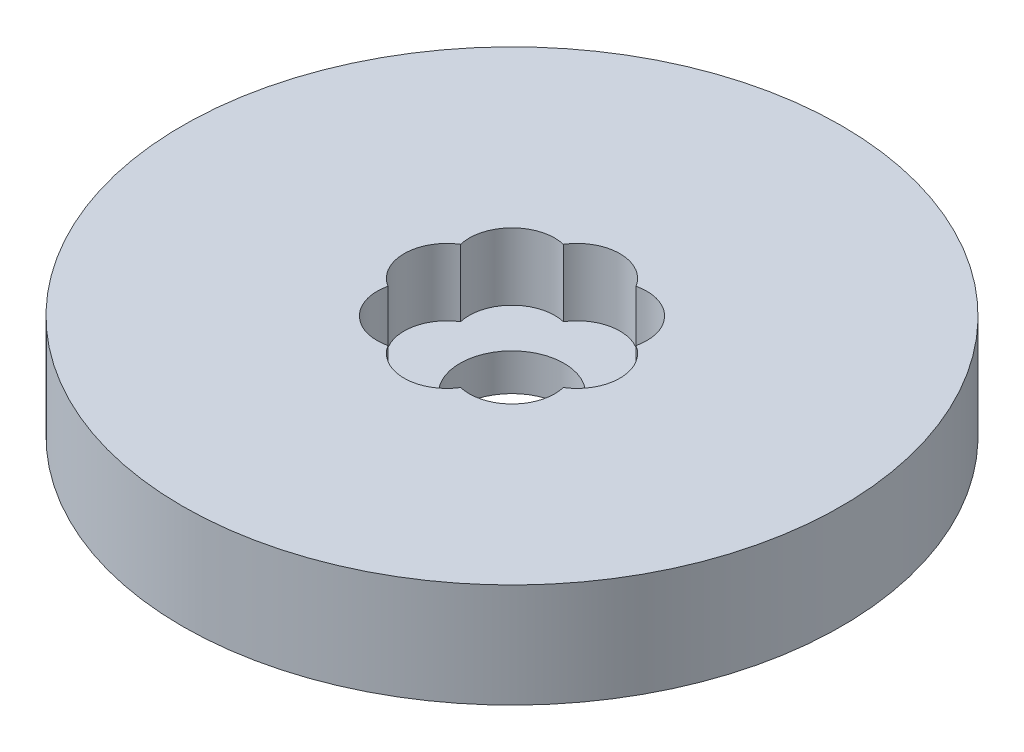
ISO-10303-21;
HEADER;
FILE_DESCRIPTION(('STEP AP214'),'2;1');
FILE_NAME('part.step','',(''),(''),'','','');
FILE_SCHEMA(('AUTOMOTIVE_DESIGN { 1 0 10303 214 1 1 1 1 }'));
ENDSEC;
DATA;
#1=APPLICATION_CONTEXT('core data for automotive mechanical design processes');
#2=APPLICATION_PROTOCOL_DEFINITION('international standard','automotive_design',2000,#1);
#3=PRODUCT_CONTEXT('',#1,'mechanical');
#4=PRODUCT('Part','Part','',(#3));
#5=PRODUCT_RELATED_PRODUCT_CATEGORY('part','',(#4));
#6=PRODUCT_DEFINITION_FORMATION('','',#4);
#7=PRODUCT_DEFINITION_CONTEXT('part definition',#1,'design');
#8=PRODUCT_DEFINITION('design','',#6,#7);
#9=PRODUCT_DEFINITION_SHAPE('','',#8);
#10=(LENGTH_UNIT() NAMED_UNIT(*) SI_UNIT(.MILLI.,.METRE.));
#11=(NAMED_UNIT(*) PLANE_ANGLE_UNIT() SI_UNIT($,.RADIAN.));
#12=(NAMED_UNIT(*) SI_UNIT($,.STERADIAN.) SOLID_ANGLE_UNIT());
#13=UNCERTAINTY_MEASURE_WITH_UNIT(LENGTH_MEASURE(1.E-05),#10,'distance_accuracy_value','');
#14=(GEOMETRIC_REPRESENTATION_CONTEXT(3) GLOBAL_UNCERTAINTY_ASSIGNED_CONTEXT((#13)) GLOBAL_UNIT_ASSIGNED_CONTEXT((#10,
#11,#12)) REPRESENTATION_CONTEXT('',''));
#15=CARTESIAN_POINT('',(0.,0.,0.));
#16=DIRECTION('',(0.,0.,1.));
#17=DIRECTION('',(1.,0.,0.));
#18=AXIS2_PLACEMENT_3D('',#15,#16,#17);
#19=CARTESIAN_POINT('',(0.,15.,0.));
#20=DIRECTION('',(0.,-1.,0.));
#21=DIRECTION('',(0.,0.,-1.));
#22=AXIS2_PLACEMENT_3D('',#19,#20,#21);
#23=CYLINDRICAL_SURFACE('',#22,7.5);
#24=CARTESIAN_POINT('',(0.,0.,0.));
#25=DIRECTION('',(0.,1.,0.));
#26=DIRECTION('',(0.,0.,1.));
#27=AXIS2_PLACEMENT_3D('',#24,#25,#26);
#28=CIRCLE('',#27,7.5);
#29=CARTESIAN_POINT('',(0.,0.,7.5));
#30=VERTEX_POINT('',#29);
#31=EDGE_CURVE('E166',#30,#30,#28,.T.);
#32=ORIENTED_EDGE('',*,*,#31,.F.);
#33=EDGE_LOOP('',(#32));
#34=FACE_BOUND('',#33,.T.);
#35=CARTESIAN_POINT('',(0.,5.33845632988203,0.));
#36=DIRECTION('',(0.,1.,0.));
#37=DIRECTION('',(0.,0.,1.));
#38=AXIS2_PLACEMENT_3D('',#35,#36,#37);
#39=CIRCLE('',#38,7.5);
#40=CARTESIAN_POINT('',(0.,5.33845632988203,7.5));
#41=VERTEX_POINT('',#40);
#42=EDGE_CURVE('E11',#41,#41,#39,.T.);
#43=ORIENTED_EDGE('',*,*,#42,.T.);
#44=EDGE_LOOP('',(#43));
#45=FACE_BOUND('',#44,.T.);
#46=ADVANCED_FACE('F39',(#34,#45),#23,.F.);
#47=CARTESIAN_POINT('',(0.,15.,0.));
#48=DIRECTION('',(0.,-1.,0.));
#49=DIRECTION('',(0.,0.,-1.));
#50=AXIS2_PLACEMENT_3D('',#47,#48,#49);
#51=CYLINDRICAL_SURFACE('',#50,47.5);
#52=CARTESIAN_POINT('',(0.,15.,0.));
#53=DIRECTION('',(0.,1.,0.));
#54=DIRECTION('',(0.,0.,1.));
#55=AXIS2_PLACEMENT_3D('',#52,#53,#54);
#56=CIRCLE('',#55,47.5);
#57=CARTESIAN_POINT('',(0.,15.,47.5));
#58=VERTEX_POINT('',#57);
#59=EDGE_CURVE('E50',#58,#58,#56,.T.);
#60=ORIENTED_EDGE('',*,*,#59,.F.);
#61=EDGE_LOOP('',(#60));
#62=FACE_BOUND('',#61,.T.);
#63=CARTESIAN_POINT('',(0.,0.,0.));
#64=DIRECTION('',(0.,1.,0.));
#65=DIRECTION('',(0.,0.,1.));
#66=AXIS2_PLACEMENT_3D('',#63,#64,#65);
#67=CIRCLE('',#66,47.5);
#68=CARTESIAN_POINT('',(0.,0.,47.5));
#69=VERTEX_POINT('',#68);
#70=EDGE_CURVE('E173',#69,#69,#67,.T.);
#71=ORIENTED_EDGE('',*,*,#70,.T.);
#72=EDGE_LOOP('',(#71));
#73=FACE_BOUND('',#72,.T.);
#74=ADVANCED_FACE('F41',(#62,#73),#51,.T.);
#75=CARTESIAN_POINT('',(0.,15.,0.));
#76=DIRECTION('',(0.,1.,0.));
#77=DIRECTION('',(0.,0.,1.));
#78=AXIS2_PLACEMENT_3D('',#75,#76,#77);
#79=PLANE('',#78);
#80=CARTESIAN_POINT('',(-6.6401751399575,15.,6.64017513995752));
#81=DIRECTION('',(0.,1.,0.));
#82=DIRECTION('',(0.707106781186549,0.,0.707106781186546));
#83=AXIS2_PLACEMENT_3D('',#80,#81,#82);
#84=CIRCLE('',#83,6.16360601817822);
#85=CARTESIAN_POINT('',(-12.6417970127063,15.,5.23640377543065));
#86=VERTEX_POINT('',#85);
#87=CARTESIAN_POINT('',(-5.23640377543061,15.,12.6417970127063));
#88=VERTEX_POINT('',#87);
#89=EDGE_CURVE('E159',#86,#88,#84,.T.);
#90=ORIENTED_EDGE('',*,*,#89,.F.);
#91=CARTESIAN_POINT('',(-9.39062573946057,15.,0.));
#92=DIRECTION('',(0.,1.,0.));
#93=DIRECTION('',(0.,0.,1.));
#94=AXIS2_PLACEMENT_3D('',#91,#92,#93);
#95=CIRCLE('',#94,6.16360601817822);
#96=CARTESIAN_POINT('',(-12.6417970127064,15.,-5.23640377543059));
#97=VERTEX_POINT('',#96);
#98=EDGE_CURVE('E167',#97,#86,#95,.T.);
#99=ORIENTED_EDGE('',*,*,#98,.F.);
#100=CARTESIAN_POINT('',(-6.64017513995759,15.,-6.64017513995743));
#101=DIRECTION('',(0.,1.,0.));
#102=DIRECTION('',(-0.707106781186539,0.,0.707106781186556));
#103=AXIS2_PLACEMENT_3D('',#100,#101,#102);
#104=CIRCLE('',#103,6.16360601817822);
#105=CARTESIAN_POINT('',(-5.23640377543078,15.,-12.6417970127063));
#106=VERTEX_POINT('',#105);
#107=EDGE_CURVE('E53',#106,#97,#104,.T.);
#108=ORIENTED_EDGE('',*,*,#107,.F.);
#109=CARTESIAN_POINT('',(0.,15.,-9.39062573946057));
#110=DIRECTION('',(0.,1.,0.));
#111=DIRECTION('',(-1.,0.,0.));
#112=AXIS2_PLACEMENT_3D('',#109,#110,#111);
#113=CIRCLE('',#112,6.16360601817822);
#114=CARTESIAN_POINT('',(5.23640377543052,15.,-12.6417970127064));
#115=VERTEX_POINT('',#114);
#116=EDGE_CURVE('E117',#115,#106,#113,.T.);
#117=ORIENTED_EDGE('',*,*,#116,.F.);
#118=CARTESIAN_POINT('',(6.64017513995745,15.,-6.64017513995757));
#119=DIRECTION('',(0.,1.,0.));
#120=DIRECTION('',(-0.707106781186554,0.,-0.707106781186541));
#121=AXIS2_PLACEMENT_3D('',#118,#119,#120);
#122=CIRCLE('',#121,6.16360601817822);
#123=CARTESIAN_POINT('',(12.6417970127063,15.,-5.23640377543068));
#124=VERTEX_POINT('',#123);
#125=EDGE_CURVE('E120',#124,#115,#122,.T.);
#126=ORIENTED_EDGE('',*,*,#125,.F.);
#127=CARTESIAN_POINT('',(9.39062573946057,15.,0.));
#128=DIRECTION('',(0.,1.,0.));
#129=DIRECTION('',(0.,0.,-1.));
#130=AXIS2_PLACEMENT_3D('',#127,#128,#129);
#131=CIRCLE('',#130,6.16360601817822);
#132=CARTESIAN_POINT('',(12.6417970127064,15.,5.23640377543062));
#133=VERTEX_POINT('',#132);
#134=EDGE_CURVE('E136',#133,#124,#131,.T.);
#135=ORIENTED_EDGE('',*,*,#134,.F.);
#136=CARTESIAN_POINT('',(6.64017513995754,15.,6.64017513995747));
#137=DIRECTION('',(0.,1.,0.));
#138=DIRECTION('',(0.707106781186544,0.,-0.707106781186551));
#139=AXIS2_PLACEMENT_3D('',#136,#137,#138);
#140=CIRCLE('',#139,6.16360601817822);
#141=CARTESIAN_POINT('',(5.23640377543069,15.,12.6417970127063));
#142=VERTEX_POINT('',#141);
#143=EDGE_CURVE('E138',#142,#133,#140,.T.);
#144=ORIENTED_EDGE('',*,*,#143,.F.);
#145=CARTESIAN_POINT('',(0.,15.,9.39062573946057));
#146=DIRECTION('',(0.,1.,0.));
#147=DIRECTION('',(1.,0.,0.));
#148=AXIS2_PLACEMENT_3D('',#145,#146,#147);
#149=CIRCLE('',#148,6.16360601817822);
#150=EDGE_CURVE('E146',#88,#142,#149,.T.);
#151=ORIENTED_EDGE('',*,*,#150,.F.);
#152=EDGE_LOOP('',(#90,#99,#108,#117,#126,#135,#144,#151));
#153=FACE_BOUND('',#152,.T.);
#154=ORIENTED_EDGE('',*,*,#59,.T.);
#155=EDGE_LOOP('',(#154));
#156=FACE_BOUND('',#155,.T.);
#157=ADVANCED_FACE('F181',(#153,#156),#79,.T.);
#158=CARTESIAN_POINT('',(0.,0.,0.));
#159=DIRECTION('',(0.,1.,0.));
#160=DIRECTION('',(0.,0.,1.));
#161=AXIS2_PLACEMENT_3D('',#158,#159,#160);
#162=PLANE('',#161);
#163=ORIENTED_EDGE('',*,*,#31,.T.);
#164=EDGE_LOOP('',(#163));
#165=FACE_BOUND('',#164,.T.);
#166=ORIENTED_EDGE('',*,*,#70,.F.);
#167=EDGE_LOOP('',(#166));
#168=FACE_BOUND('',#167,.T.);
#169=ADVANCED_FACE('F179',(#165,#168),#162,.F.);
#170=CARTESIAN_POINT('',(-9.39062573946057,5.33845632988203,0.));
#171=DIRECTION('',(0.,1.,0.));
#172=DIRECTION('',(0.,0.,1.));
#173=AXIS2_PLACEMENT_3D('',#170,#171,#172);
#174=CYLINDRICAL_SURFACE('',#173,6.16360601817822);
#175=ORIENTED_EDGE('',*,*,#98,.T.);
#176=DIRECTION('',(0.,1.,0.));
#177=VECTOR('',#176,1.);
#178=CARTESIAN_POINT('',(-12.6417970127063,10.169228164941,5.23640377543065));
#179=LINE('',#178,#177);
#180=CARTESIAN_POINT('',(-12.6417970127063,5.33845632988203,5.23640377543065));
#181=VERTEX_POINT('',#180);
#182=EDGE_CURVE('E65',#86,#181,#179,.F.);
#183=ORIENTED_EDGE('',*,*,#182,.T.);
#184=CARTESIAN_POINT('',(-9.39062573946057,5.33845632988203,0.));
#185=DIRECTION('',(0.,1.,0.));
#186=DIRECTION('',(0.,0.,1.));
#187=AXIS2_PLACEMENT_3D('',#184,#185,#186);
#188=CIRCLE('',#187,6.16360601817822);
#189=CARTESIAN_POINT('',(-12.6417970127064,5.33845632988203,-5.23640377543059));
#190=VERTEX_POINT('',#189);
#191=EDGE_CURVE('E170',#190,#181,#188,.T.);
#192=ORIENTED_EDGE('',*,*,#191,.F.);
#193=DIRECTION('',(0.,1.,0.));
#194=VECTOR('',#193,1.);
#195=CARTESIAN_POINT('',(-12.6417970127064,10.169228164941,-5.23640377543059));
#196=LINE('',#195,#194);
#197=EDGE_CURVE('E124',#190,#97,#196,.T.);
#198=ORIENTED_EDGE('',*,*,#197,.T.);
#199=EDGE_LOOP('',(#175,#183,#192,#198));
#200=FACE_BOUND('',#199,.T.);
#201=ADVANCED_FACE('F185',(#200),#174,.F.);
#202=CARTESIAN_POINT('',(-9.39062573946057,5.33845632988203,0.));
#203=DIRECTION('',(0.,1.,0.));
#204=DIRECTION('',(0.,0.,1.));
#205=AXIS2_PLACEMENT_3D('',#202,#203,#204);
#206=PLANE('',#205);
#207=ORIENTED_EDGE('',*,*,#191,.T.);
#208=CARTESIAN_POINT('',(-6.6401751399575,5.33845632988203,6.64017513995752));
#209=DIRECTION('',(0.,1.,0.));
#210=DIRECTION('',(0.707106781186549,0.,0.707106781186546));
#211=AXIS2_PLACEMENT_3D('',#208,#209,#210);
#212=CIRCLE('',#211,6.16360601817822);
#213=CARTESIAN_POINT('',(-5.23640377543061,5.33845632988203,12.6417970127063));
#214=VERTEX_POINT('',#213);
#215=EDGE_CURVE('E161',#181,#214,#212,.T.);
#216=ORIENTED_EDGE('',*,*,#215,.T.);
#217=CARTESIAN_POINT('',(0.,5.33845632988203,9.39062573946057));
#218=DIRECTION('',(0.,1.,0.));
#219=DIRECTION('',(1.,0.,0.));
#220=AXIS2_PLACEMENT_3D('',#217,#218,#219);
#221=CIRCLE('',#220,6.16360601817822);
#222=CARTESIAN_POINT('',(5.23640377543069,5.33845632988203,12.6417970127063));
#223=VERTEX_POINT('',#222);
#224=EDGE_CURVE('E149',#214,#223,#221,.T.);
#225=ORIENTED_EDGE('',*,*,#224,.T.);
#226=CARTESIAN_POINT('',(6.64017513995754,5.33845632988203,6.64017513995747));
#227=DIRECTION('',(0.,1.,0.));
#228=DIRECTION('',(0.707106781186544,0.,-0.707106781186551));
#229=AXIS2_PLACEMENT_3D('',#226,#227,#228);
#230=CIRCLE('',#229,6.16360601817822);
#231=CARTESIAN_POINT('',(12.6417970127064,5.33845632988203,5.23640377543062));
#232=VERTEX_POINT('',#231);
#233=EDGE_CURVE('E143',#223,#232,#230,.T.);
#234=ORIENTED_EDGE('',*,*,#233,.T.);
#235=CARTESIAN_POINT('',(9.39062573946057,5.33845632988203,0.));
#236=DIRECTION('',(0.,1.,0.));
#237=DIRECTION('',(0.,0.,-1.));
#238=AXIS2_PLACEMENT_3D('',#235,#236,#237);
#239=CIRCLE('',#238,6.16360601817822);
#240=CARTESIAN_POINT('',(12.6417970127063,5.33845632988203,-5.23640377543068));
#241=VERTEX_POINT('',#240);
#242=EDGE_CURVE('E140',#232,#241,#239,.T.);
#243=ORIENTED_EDGE('',*,*,#242,.T.);
#244=CARTESIAN_POINT('',(6.64017513995745,5.33845632988203,-6.64017513995757));
#245=DIRECTION('',(0.,1.,0.));
#246=DIRECTION('',(-0.707106781186554,0.,-0.707106781186541));
#247=AXIS2_PLACEMENT_3D('',#244,#245,#246);
#248=CIRCLE('',#247,6.16360601817822);
#249=CARTESIAN_POINT('',(5.23640377543052,5.33845632988203,-12.6417970127064));
#250=VERTEX_POINT('',#249);
#251=EDGE_CURVE('E111',#241,#250,#248,.T.);
#252=ORIENTED_EDGE('',*,*,#251,.T.);
#253=CARTESIAN_POINT('',(0.,5.33845632988203,-9.39062573946057));
#254=DIRECTION('',(0.,1.,0.));
#255=DIRECTION('',(-1.,0.,0.));
#256=AXIS2_PLACEMENT_3D('',#253,#254,#255);
#257=CIRCLE('',#256,6.16360601817822);
#258=CARTESIAN_POINT('',(-5.23640377543078,5.33845632988203,-12.6417970127063));
#259=VERTEX_POINT('',#258);
#260=EDGE_CURVE('E104',#250,#259,#257,.T.);
#261=ORIENTED_EDGE('',*,*,#260,.T.);
#262=CARTESIAN_POINT('',(-6.64017513995759,5.33845632988203,-6.64017513995743));
#263=DIRECTION('',(0.,1.,0.));
#264=DIRECTION('',(-0.707106781186539,0.,0.707106781186556));
#265=AXIS2_PLACEMENT_3D('',#262,#263,#264);
#266=CIRCLE('',#265,6.16360601817822);
#267=EDGE_CURVE('E112',#259,#190,#266,.T.);
#268=ORIENTED_EDGE('',*,*,#267,.T.);
#269=EDGE_LOOP('',(#207,#216,#225,#234,#243,#252,#261,#268));
#270=FACE_BOUND('',#269,.T.);
#271=ORIENTED_EDGE('',*,*,#42,.F.);
#272=EDGE_LOOP('',(#271));
#273=FACE_BOUND('',#272,.T.);
#274=ADVANCED_FACE('F107',(#270,#273),#206,.T.);
#275=CARTESIAN_POINT('',(-6.6401751399575,5.33845632988203,6.64017513995752));
#276=DIRECTION('',(0.,1.,0.));
#277=DIRECTION('',(0.,0.,1.));
#278=AXIS2_PLACEMENT_3D('',#275,#276,#277);
#279=CYLINDRICAL_SURFACE('',#278,6.16360601817822);
#280=ORIENTED_EDGE('',*,*,#89,.T.);
#281=DIRECTION('',(0.,1.,0.));
#282=VECTOR('',#281,1.);
#283=CARTESIAN_POINT('',(-5.23640377543061,10.169228164941,12.6417970127063));
#284=LINE('',#283,#282);
#285=EDGE_CURVE('E160',#88,#214,#284,.F.);
#286=ORIENTED_EDGE('',*,*,#285,.T.);
#287=ORIENTED_EDGE('',*,*,#215,.F.);
#288=ORIENTED_EDGE('',*,*,#182,.F.);
#289=EDGE_LOOP('',(#280,#286,#287,#288));
#290=FACE_BOUND('',#289,.T.);
#291=ADVANCED_FACE('F202',(#290),#279,.F.);
#292=CARTESIAN_POINT('',(-6.64017513995759,5.33845632988203,-6.64017513995743));
#293=DIRECTION('',(0.,1.,0.));
#294=DIRECTION('',(0.,0.,1.));
#295=AXIS2_PLACEMENT_3D('',#292,#293,#294);
#296=CYLINDRICAL_SURFACE('',#295,6.16360601817822);
#297=ORIENTED_EDGE('',*,*,#267,.F.);
#298=DIRECTION('',(0.,1.,0.));
#299=VECTOR('',#298,1.);
#300=CARTESIAN_POINT('',(-5.23640377543078,10.169228164941,-12.6417970127063));
#301=LINE('',#300,#299);
#302=EDGE_CURVE('E119',#106,#259,#301,.F.);
#303=ORIENTED_EDGE('',*,*,#302,.F.);
#304=ORIENTED_EDGE('',*,*,#107,.T.);
#305=ORIENTED_EDGE('',*,*,#197,.F.);
#306=EDGE_LOOP('',(#297,#303,#304,#305));
#307=FACE_BOUND('',#306,.T.);
#308=ADVANCED_FACE('F123',(#307),#296,.F.);
#309=CARTESIAN_POINT('',(0.,5.33845632988203,9.39062573946057));
#310=DIRECTION('',(0.,1.,0.));
#311=DIRECTION('',(0.,0.,1.));
#312=AXIS2_PLACEMENT_3D('',#309,#310,#311);
#313=CYLINDRICAL_SURFACE('',#312,6.16360601817822);
#314=ORIENTED_EDGE('',*,*,#150,.T.);
#315=DIRECTION('',(0.,1.,0.));
#316=VECTOR('',#315,1.);
#317=CARTESIAN_POINT('',(5.23640377543069,10.169228164941,12.6417970127063));
#318=LINE('',#317,#316);
#319=EDGE_CURVE('E141',#142,#223,#318,.F.);
#320=ORIENTED_EDGE('',*,*,#319,.T.);
#321=ORIENTED_EDGE('',*,*,#224,.F.);
#322=ORIENTED_EDGE('',*,*,#285,.F.);
#323=EDGE_LOOP('',(#314,#320,#321,#322));
#324=FACE_BOUND('',#323,.T.);
#325=ADVANCED_FACE('F208',(#324),#313,.F.);
#326=CARTESIAN_POINT('',(6.64017513995754,5.33845632988203,6.64017513995747));
#327=DIRECTION('',(0.,1.,0.));
#328=DIRECTION('',(0.,0.,1.));
#329=AXIS2_PLACEMENT_3D('',#326,#327,#328);
#330=CYLINDRICAL_SURFACE('',#329,6.16360601817822);
#331=DIRECTION('',(0.,1.,0.));
#332=VECTOR('',#331,1.);
#333=CARTESIAN_POINT('',(12.6417970127064,10.169228164941,5.23640377543062));
#334=LINE('',#333,#332);
#335=EDGE_CURVE('E151',#133,#232,#334,.F.);
#336=ORIENTED_EDGE('',*,*,#335,.T.);
#337=ORIENTED_EDGE('',*,*,#233,.F.);
#338=ORIENTED_EDGE('',*,*,#319,.F.);
#339=ORIENTED_EDGE('',*,*,#143,.T.);
#340=EDGE_LOOP('',(#336,#337,#338,#339));
#341=FACE_BOUND('',#340,.T.);
#342=ADVANCED_FACE('F211',(#341),#330,.F.);
#343=CARTESIAN_POINT('',(9.39062573946057,5.33845632988203,0.));
#344=DIRECTION('',(0.,1.,0.));
#345=DIRECTION('',(0.,0.,1.));
#346=AXIS2_PLACEMENT_3D('',#343,#344,#345);
#347=CYLINDRICAL_SURFACE('',#346,6.16360601817822);
#348=ORIENTED_EDGE('',*,*,#134,.T.);
#349=DIRECTION('',(0.,1.,0.));
#350=VECTOR('',#349,1.);
#351=CARTESIAN_POINT('',(12.6417970127063,10.169228164941,-5.23640377543068));
#352=LINE('',#351,#350);
#353=EDGE_CURVE('E131',#124,#241,#352,.F.);
#354=ORIENTED_EDGE('',*,*,#353,.T.);
#355=ORIENTED_EDGE('',*,*,#242,.F.);
#356=ORIENTED_EDGE('',*,*,#335,.F.);
#357=EDGE_LOOP('',(#348,#354,#355,#356));
#358=FACE_BOUND('',#357,.T.);
#359=ADVANCED_FACE('F214',(#358),#347,.F.);
#360=CARTESIAN_POINT('',(6.64017513995745,5.33845632988203,-6.64017513995757));
#361=DIRECTION('',(0.,1.,0.));
#362=DIRECTION('',(0.,0.,1.));
#363=AXIS2_PLACEMENT_3D('',#360,#361,#362);
#364=CYLINDRICAL_SURFACE('',#363,6.16360601817822);
#365=DIRECTION('',(0.,1.,0.));
#366=VECTOR('',#365,1.);
#367=CARTESIAN_POINT('',(5.23640377543052,10.169228164941,-12.6417970127064));
#368=LINE('',#367,#366);
#369=EDGE_CURVE('E154',#115,#250,#368,.F.);
#370=ORIENTED_EDGE('',*,*,#369,.T.);
#371=ORIENTED_EDGE('',*,*,#251,.F.);
#372=ORIENTED_EDGE('',*,*,#353,.F.);
#373=ORIENTED_EDGE('',*,*,#125,.T.);
#374=EDGE_LOOP('',(#370,#371,#372,#373));
#375=FACE_BOUND('',#374,.T.);
#376=ADVANCED_FACE('F218',(#375),#364,.F.);
#377=CARTESIAN_POINT('',(0.,5.33845632988203,-9.39062573946057));
#378=DIRECTION('',(0.,1.,0.));
#379=DIRECTION('',(0.,0.,1.));
#380=AXIS2_PLACEMENT_3D('',#377,#378,#379);
#381=CYLINDRICAL_SURFACE('',#380,6.16360601817822);
#382=ORIENTED_EDGE('',*,*,#116,.T.);
#383=ORIENTED_EDGE('',*,*,#302,.T.);
#384=ORIENTED_EDGE('',*,*,#260,.F.);
#385=ORIENTED_EDGE('',*,*,#369,.F.);
#386=EDGE_LOOP('',(#382,#383,#384,#385));
#387=FACE_BOUND('',#386,.T.);
#388=ADVANCED_FACE('F121',(#387),#381,.F.);
#389=CLOSED_SHELL('',(#46,#74,#157,#169,#201,#274,#291,#308,#325,#342,#359,#376,#388));
#390=MANIFOLD_SOLID_BREP('B2',#389);
#391=ADVANCED_BREP_SHAPE_REPRESENTATION('',(#18,#390),#14);
#392=SHAPE_DEFINITION_REPRESENTATION(#9,#391);
ENDSEC;
END-ISO-10303-21;
